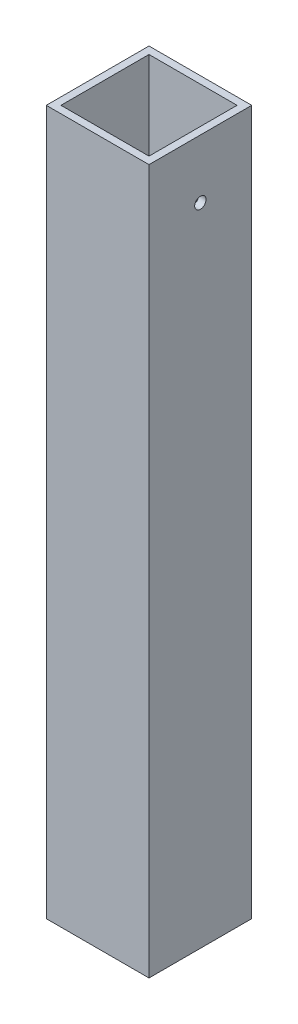
ISO-10303-21;
HEADER;
FILE_DESCRIPTION(('STEP AP214'),'2;1');
FILE_NAME('part.step','',(''),(''),'','','');
FILE_SCHEMA(('AUTOMOTIVE_DESIGN { 1 0 10303 214 1 1 1 1 }'));
ENDSEC;
DATA;
#1=APPLICATION_CONTEXT('core data for automotive mechanical design processes');
#2=APPLICATION_PROTOCOL_DEFINITION('international standard','automotive_design',2000,#1);
#3=PRODUCT_CONTEXT('',#1,'mechanical');
#4=PRODUCT('Part','Part','',(#3));
#5=PRODUCT_RELATED_PRODUCT_CATEGORY('part','',(#4));
#6=PRODUCT_DEFINITION_FORMATION('','',#4);
#7=PRODUCT_DEFINITION_CONTEXT('part definition',#1,'design');
#8=PRODUCT_DEFINITION('design','',#6,#7);
#9=PRODUCT_DEFINITION_SHAPE('','',#8);
#10=(LENGTH_UNIT() NAMED_UNIT(*) SI_UNIT(.MILLI.,.METRE.));
#11=(NAMED_UNIT(*) PLANE_ANGLE_UNIT() SI_UNIT($,.RADIAN.));
#12=(NAMED_UNIT(*) SI_UNIT($,.STERADIAN.) SOLID_ANGLE_UNIT());
#13=UNCERTAINTY_MEASURE_WITH_UNIT(LENGTH_MEASURE(1.E-05),#10,'distance_accuracy_value','');
#14=(GEOMETRIC_REPRESENTATION_CONTEXT(3) GLOBAL_UNCERTAINTY_ASSIGNED_CONTEXT((#13)) GLOBAL_UNIT_ASSIGNED_CONTEXT((#10,
#11,#12)) REPRESENTATION_CONTEXT('',''));
#15=CARTESIAN_POINT('',(0.,0.,0.));
#16=DIRECTION('',(0.,0.,1.));
#17=DIRECTION('',(1.,0.,0.));
#18=AXIS2_PLACEMENT_3D('',#15,#16,#17);
#19=CARTESIAN_POINT('',(746.266107909946,-485.775,1.37475685413339E-13));
#20=DIRECTION('',(1.,0.,0.));
#21=DIRECTION('',(0.,0.,-1.));
#22=AXIS2_PLACEMENT_3D('',#19,#20,#21);
#23=CYLINDRICAL_SURFACE('',#22,2.45745);
#24=CARTESIAN_POINT('',(22.2250000000001,-485.775,0.));
#25=DIRECTION('',(1.,0.,0.));
#26=DIRECTION('',(0.,0.,-1.));
#27=AXIS2_PLACEMENT_3D('',#24,#25,#26);
#28=CIRCLE('',#27,2.45745);
#29=CARTESIAN_POINT('',(22.2250000000001,-485.775,-2.45745));
#30=VERTEX_POINT('',#29);
#31=EDGE_CURVE('E111',#30,#30,#28,.T.);
#32=ORIENTED_EDGE('',*,*,#31,.T.);
#33=EDGE_LOOP('',(#32));
#34=FACE_BOUND('',#33,.T.);
#35=CARTESIAN_POINT('',(19.05,-485.775,0.));
#36=DIRECTION('',(1.,0.,0.));
#37=DIRECTION('',(0.,0.,-1.));
#38=AXIS2_PLACEMENT_3D('',#35,#36,#37);
#39=CIRCLE('',#38,2.45745);
#40=CARTESIAN_POINT('',(19.05,-485.775,-2.45745));
#41=VERTEX_POINT('',#40);
#42=EDGE_CURVE('E17',#41,#41,#39,.T.);
#43=ORIENTED_EDGE('',*,*,#42,.F.);
#44=EDGE_LOOP('',(#43));
#45=FACE_BOUND('',#44,.T.);
#46=ADVANCED_FACE('F14',(#34,#45),#23,.F.);
#47=CARTESIAN_POINT('',(746.266107909946,-485.775,1.37475685413339E-13));
#48=DIRECTION('',(1.,0.,0.));
#49=DIRECTION('',(0.,0.,-1.));
#50=AXIS2_PLACEMENT_3D('',#47,#48,#49);
#51=CYLINDRICAL_SURFACE('',#50,2.45745);
#52=CARTESIAN_POINT('',(-19.05,-485.775,0.));
#53=DIRECTION('',(1.,0.,0.));
#54=DIRECTION('',(0.,0.,-1.));
#55=AXIS2_PLACEMENT_3D('',#52,#53,#54);
#56=CIRCLE('',#55,2.45745);
#57=CARTESIAN_POINT('',(-19.05,-485.775,-2.45745));
#58=VERTEX_POINT('',#57);
#59=EDGE_CURVE('E115',#58,#58,#56,.T.);
#60=ORIENTED_EDGE('',*,*,#59,.T.);
#61=EDGE_LOOP('',(#60));
#62=FACE_BOUND('',#61,.T.);
#63=CARTESIAN_POINT('',(-22.2250000000001,-485.775,0.));
#64=DIRECTION('',(1.,0.,0.));
#65=DIRECTION('',(0.,0.,-1.));
#66=AXIS2_PLACEMENT_3D('',#63,#64,#65);
#67=CIRCLE('',#66,2.45745);
#68=CARTESIAN_POINT('',(-22.2250000000001,-485.775,-2.45745));
#69=VERTEX_POINT('',#68);
#70=EDGE_CURVE('E117',#69,#69,#67,.T.);
#71=ORIENTED_EDGE('',*,*,#70,.F.);
#72=EDGE_LOOP('',(#71));
#73=FACE_BOUND('',#72,.T.);
#74=ADVANCED_FACE('F126',(#62,#73),#51,.F.);
#75=CARTESIAN_POINT('',(19.05,-460.375,-3.75820513665676));
#76=DIRECTION('',(-1.,0.,0.));
#77=DIRECTION('',(0.,0.,1.));
#78=AXIS2_PLACEMENT_3D('',#75,#76,#77);
#79=PLANE('',#78);
#80=DIRECTION('',(0.,0.,1.));
#81=VECTOR('',#80,1.);
#82=CARTESIAN_POINT('',(19.05,-460.375,0.));
#83=LINE('',#82,#81);
#84=CARTESIAN_POINT('',(19.05,-460.375,-19.05));
#85=VERTEX_POINT('',#84);
#86=CARTESIAN_POINT('',(19.05,-460.375,19.05));
#87=VERTEX_POINT('',#86);
#88=EDGE_CURVE('E95',#85,#87,#83,.T.);
#89=ORIENTED_EDGE('',*,*,#88,.F.);
#90=DIRECTION('',(0.,1.,0.));
#91=VECTOR('',#90,1.);
#92=CARTESIAN_POINT('',(19.05,-460.375,-19.05));
#93=LINE('',#92,#91);
#94=CARTESIAN_POINT('',(19.05,-765.175,-19.05));
#95=VERTEX_POINT('',#94);
#96=EDGE_CURVE('E82',#95,#85,#93,.T.);
#97=ORIENTED_EDGE('',*,*,#96,.F.);
#98=DIRECTION('',(0.,0.,1.));
#99=VECTOR('',#98,1.);
#100=CARTESIAN_POINT('',(19.05,-765.175,0.));
#101=LINE('',#100,#99);
#102=CARTESIAN_POINT('',(19.05,-765.175,19.05));
#103=VERTEX_POINT('',#102);
#104=EDGE_CURVE('E180',#95,#103,#101,.T.);
#105=ORIENTED_EDGE('',*,*,#104,.T.);
#106=DIRECTION('',(0.,1.,0.));
#107=VECTOR('',#106,1.);
#108=CARTESIAN_POINT('',(19.05,-460.375,19.05));
#109=LINE('',#108,#107);
#110=EDGE_CURVE('E102',#103,#87,#109,.T.);
#111=ORIENTED_EDGE('',*,*,#110,.T.);
#112=EDGE_LOOP('',(#89,#97,#105,#111));
#113=FACE_BOUND('',#112,.T.);
#114=ORIENTED_EDGE('',*,*,#42,.T.);
#115=EDGE_LOOP('',(#114));
#116=FACE_BOUND('',#115,.T.);
#117=ADVANCED_FACE('F100',(#113,#116),#79,.T.);
#118=CARTESIAN_POINT('',(1.89634043574333,-460.375,19.05));
#119=DIRECTION('',(0.,0.,1.));
#120=DIRECTION('',(1.,0.,0.));
#121=AXIS2_PLACEMENT_3D('',#118,#119,#120);
#122=PLANE('',#121);
#123=DIRECTION('',(0.,1.,0.));
#124=VECTOR('',#123,1.);
#125=CARTESIAN_POINT('',(-19.05,-460.375,19.05));
#126=LINE('',#125,#124);
#127=CARTESIAN_POINT('',(-19.05,-765.175,19.05));
#128=VERTEX_POINT('',#127);
#129=CARTESIAN_POINT('',(-19.05,-460.375,19.05));
#130=VERTEX_POINT('',#129);
#131=EDGE_CURVE('E91',#128,#130,#126,.T.);
#132=ORIENTED_EDGE('',*,*,#131,.T.);
#133=DIRECTION('',(1.,0.,0.));
#134=VECTOR('',#133,1.);
#135=CARTESIAN_POINT('',(-192.0875,-460.375,19.05));
#136=LINE('',#135,#134);
#137=EDGE_CURVE('E104',#87,#130,#136,.F.);
#138=ORIENTED_EDGE('',*,*,#137,.F.);
#139=ORIENTED_EDGE('',*,*,#110,.F.);
#140=DIRECTION('',(1.,0.,0.));
#141=VECTOR('',#140,1.);
#142=CARTESIAN_POINT('',(-192.0875,-765.175,19.05));
#143=LINE('',#142,#141);
#144=EDGE_CURVE('E182',#103,#128,#143,.F.);
#145=ORIENTED_EDGE('',*,*,#144,.T.);
#146=EDGE_LOOP('',(#132,#138,#139,#145));
#147=FACE_BOUND('',#146,.T.);
#148=ADVANCED_FACE('F131',(#147),#122,.F.);
#149=CARTESIAN_POINT('',(-19.05,-460.375,-3.75820513665677));
#150=DIRECTION('',(-1.,0.,0.));
#151=DIRECTION('',(0.,0.,1.));
#152=AXIS2_PLACEMENT_3D('',#149,#150,#151);
#153=PLANE('',#152);
#154=DIRECTION('',(0.,1.,0.));
#155=VECTOR('',#154,1.);
#156=CARTESIAN_POINT('',(-19.05,-460.375,-19.05));
#157=LINE('',#156,#155);
#158=CARTESIAN_POINT('',(-19.05,-460.375,-19.05));
#159=VERTEX_POINT('',#158);
#160=CARTESIAN_POINT('',(-19.05,-765.175,-19.05));
#161=VERTEX_POINT('',#160);
#162=EDGE_CURVE('E75',#159,#161,#157,.F.);
#163=ORIENTED_EDGE('',*,*,#162,.F.);
#164=DIRECTION('',(0.,0.,1.));
#165=VECTOR('',#164,1.);
#166=CARTESIAN_POINT('',(-19.05,-460.375,0.));
#167=LINE('',#166,#165);
#168=EDGE_CURVE('E97',#130,#159,#167,.F.);
#169=ORIENTED_EDGE('',*,*,#168,.F.);
#170=ORIENTED_EDGE('',*,*,#131,.F.);
#171=DIRECTION('',(0.,0.,1.));
#172=VECTOR('',#171,1.);
#173=CARTESIAN_POINT('',(-19.05,-765.175,0.));
#174=LINE('',#173,#172);
#175=EDGE_CURVE('E202',#128,#161,#174,.F.);
#176=ORIENTED_EDGE('',*,*,#175,.T.);
#177=EDGE_LOOP('',(#163,#169,#170,#176));
#178=FACE_BOUND('',#177,.T.);
#179=ORIENTED_EDGE('',*,*,#59,.F.);
#180=EDGE_LOOP('',(#179));
#181=FACE_BOUND('',#180,.T.);
#182=ADVANCED_FACE('F129',(#178,#181),#153,.F.);
#183=CARTESIAN_POINT('',(0.,-460.375,-19.05));
#184=DIRECTION('',(0.,0.,1.));
#185=DIRECTION('',(1.,0.,0.));
#186=AXIS2_PLACEMENT_3D('',#183,#184,#185);
#187=PLANE('',#186);
#188=DIRECTION('',(1.,0.,0.));
#189=VECTOR('',#188,1.);
#190=CARTESIAN_POINT('',(-192.0875,-460.375,-19.05));
#191=LINE('',#190,#189);
#192=EDGE_CURVE('E85',#159,#85,#191,.T.);
#193=ORIENTED_EDGE('',*,*,#192,.F.);
#194=ORIENTED_EDGE('',*,*,#162,.T.);
#195=DIRECTION('',(1.,0.,0.));
#196=VECTOR('',#195,1.);
#197=CARTESIAN_POINT('',(-192.0875,-765.175,-19.05));
#198=LINE('',#197,#196);
#199=EDGE_CURVE('E87',#161,#95,#198,.T.);
#200=ORIENTED_EDGE('',*,*,#199,.T.);
#201=ORIENTED_EDGE('',*,*,#96,.T.);
#202=EDGE_LOOP('',(#193,#194,#200,#201));
#203=FACE_BOUND('',#202,.T.);
#204=ADVANCED_FACE('F84',(#203),#187,.T.);
#205=CARTESIAN_POINT('',(-192.0875,-460.375,22.225));
#206=DIRECTION('',(0.,0.,1.));
#207=DIRECTION('',(1.,0.,0.));
#208=AXIS2_PLACEMENT_3D('',#205,#206,#207);
#209=PLANE('',#208);
#210=DIRECTION('',(1.,0.,0.));
#211=VECTOR('',#210,1.);
#212=CARTESIAN_POINT('',(-192.0875,-460.375,22.225));
#213=LINE('',#212,#211);
#214=CARTESIAN_POINT('',(-22.225,-460.375,22.225));
#215=VERTEX_POINT('',#214);
#216=CARTESIAN_POINT('',(22.225,-460.375,22.225));
#217=VERTEX_POINT('',#216);
#218=EDGE_CURVE('E170',#215,#217,#213,.T.);
#219=ORIENTED_EDGE('',*,*,#218,.F.);
#220=DIRECTION('',(0.,1.,0.));
#221=VECTOR('',#220,1.);
#222=CARTESIAN_POINT('',(-22.225,-460.375,22.225));
#223=LINE('',#222,#221);
#224=CARTESIAN_POINT('',(-22.225,-765.175,22.225));
#225=VERTEX_POINT('',#224);
#226=EDGE_CURVE('E120',#225,#215,#223,.T.);
#227=ORIENTED_EDGE('',*,*,#226,.F.);
#228=DIRECTION('',(1.,0.,0.));
#229=VECTOR('',#228,1.);
#230=CARTESIAN_POINT('',(-192.0875,-765.175,22.225));
#231=LINE('',#230,#229);
#232=CARTESIAN_POINT('',(22.225,-765.175,22.225));
#233=VERTEX_POINT('',#232);
#234=EDGE_CURVE('E199',#225,#233,#231,.T.);
#235=ORIENTED_EDGE('',*,*,#234,.T.);
#236=DIRECTION('',(0.,1.,0.));
#237=VECTOR('',#236,1.);
#238=CARTESIAN_POINT('',(22.225,-460.375,22.225));
#239=LINE('',#238,#237);
#240=EDGE_CURVE('E98',#233,#217,#239,.T.);
#241=ORIENTED_EDGE('',*,*,#240,.T.);
#242=EDGE_LOOP('',(#219,#227,#235,#241));
#243=FACE_BOUND('',#242,.T.);
#244=ADVANCED_FACE('F138',(#243),#209,.T.);
#245=CARTESIAN_POINT('',(22.225,-460.375,-3.75820513665676));
#246=DIRECTION('',(-1.,0.,0.));
#247=DIRECTION('',(0.,0.,1.));
#248=AXIS2_PLACEMENT_3D('',#245,#246,#247);
#249=PLANE('',#248);
#250=DIRECTION('',(0.,1.,0.));
#251=VECTOR('',#250,1.);
#252=CARTESIAN_POINT('',(22.225,-460.375,-22.225));
#253=LINE('',#252,#251);
#254=CARTESIAN_POINT('',(22.225,-765.175,-22.225));
#255=VERTEX_POINT('',#254);
#256=CARTESIAN_POINT('',(22.225,-460.375,-22.225));
#257=VERTEX_POINT('',#256);
#258=EDGE_CURVE('E188',#255,#257,#253,.T.);
#259=ORIENTED_EDGE('',*,*,#258,.T.);
#260=DIRECTION('',(0.,0.,1.));
#261=VECTOR('',#260,1.);
#262=CARTESIAN_POINT('',(22.225,-460.375,0.));
#263=LINE('',#262,#261);
#264=EDGE_CURVE('E121',#217,#257,#263,.F.);
#265=ORIENTED_EDGE('',*,*,#264,.F.);
#266=ORIENTED_EDGE('',*,*,#240,.F.);
#267=DIRECTION('',(0.,0.,1.));
#268=VECTOR('',#267,1.);
#269=CARTESIAN_POINT('',(22.225,-765.175,0.));
#270=LINE('',#269,#268);
#271=EDGE_CURVE('E193',#233,#255,#270,.F.);
#272=ORIENTED_EDGE('',*,*,#271,.T.);
#273=EDGE_LOOP('',(#259,#265,#266,#272));
#274=FACE_BOUND('',#273,.T.);
#275=ORIENTED_EDGE('',*,*,#31,.F.);
#276=EDGE_LOOP('',(#275));
#277=FACE_BOUND('',#276,.T.);
#278=ADVANCED_FACE('F159',(#274,#277),#249,.F.);
#279=CARTESIAN_POINT('',(-192.0875,-460.375,0.));
#280=DIRECTION('',(0.,1.,0.));
#281=DIRECTION('',(0.,0.,1.));
#282=AXIS2_PLACEMENT_3D('',#279,#280,#281);
#283=PLANE('',#282);
#284=ORIENTED_EDGE('',*,*,#264,.T.);
#285=DIRECTION('',(1.,0.,0.));
#286=VECTOR('',#285,1.);
#287=CARTESIAN_POINT('',(-192.0875,-460.375,-22.225));
#288=LINE('',#287,#286);
#289=CARTESIAN_POINT('',(-22.225,-460.375,-22.225));
#290=VERTEX_POINT('',#289);
#291=EDGE_CURVE('E178',#257,#290,#288,.F.);
#292=ORIENTED_EDGE('',*,*,#291,.T.);
#293=DIRECTION('',(0.,0.,1.));
#294=VECTOR('',#293,1.);
#295=CARTESIAN_POINT('',(-22.225,-460.375,-3.75820513665677));
#296=LINE('',#295,#294);
#297=EDGE_CURVE('E176',#215,#290,#296,.F.);
#298=ORIENTED_EDGE('',*,*,#297,.F.);
#299=ORIENTED_EDGE('',*,*,#218,.T.);
#300=EDGE_LOOP('',(#284,#292,#298,#299));
#301=FACE_BOUND('',#300,.T.);
#302=ORIENTED_EDGE('',*,*,#137,.T.);
#303=ORIENTED_EDGE('',*,*,#168,.T.);
#304=ORIENTED_EDGE('',*,*,#192,.T.);
#305=ORIENTED_EDGE('',*,*,#88,.T.);
#306=EDGE_LOOP('',(#302,#303,#304,#305));
#307=FACE_BOUND('',#306,.T.);
#308=ADVANCED_FACE('F94',(#301,#307),#283,.T.);
#309=CARTESIAN_POINT('',(-22.225,-460.375,-3.75820513665677));
#310=DIRECTION('',(-1.,0.,0.));
#311=DIRECTION('',(0.,0.,1.));
#312=AXIS2_PLACEMENT_3D('',#309,#310,#311);
#313=PLANE('',#312);
#314=ORIENTED_EDGE('',*,*,#297,.T.);
#315=DIRECTION('',(0.,1.,0.));
#316=VECTOR('',#315,1.);
#317=CARTESIAN_POINT('',(-22.225,-460.375,-22.225));
#318=LINE('',#317,#316);
#319=CARTESIAN_POINT('',(-22.225,-765.175,-22.225));
#320=VERTEX_POINT('',#319);
#321=EDGE_CURVE('E23',#290,#320,#318,.F.);
#322=ORIENTED_EDGE('',*,*,#321,.T.);
#323=DIRECTION('',(0.,0.,1.));
#324=VECTOR('',#323,1.);
#325=CARTESIAN_POINT('',(-22.225,-765.175,0.));
#326=LINE('',#325,#324);
#327=EDGE_CURVE('E31',#320,#225,#326,.T.);
#328=ORIENTED_EDGE('',*,*,#327,.T.);
#329=ORIENTED_EDGE('',*,*,#226,.T.);
#330=EDGE_LOOP('',(#314,#322,#328,#329));
#331=FACE_BOUND('',#330,.T.);
#332=ORIENTED_EDGE('',*,*,#70,.T.);
#333=EDGE_LOOP('',(#332));
#334=FACE_BOUND('',#333,.T.);
#335=ADVANCED_FACE('F150',(#331,#334),#313,.T.);
#336=CARTESIAN_POINT('',(-192.0875,-765.175,0.));
#337=DIRECTION('',(0.,1.,0.));
#338=DIRECTION('',(0.,0.,1.));
#339=AXIS2_PLACEMENT_3D('',#336,#337,#338);
#340=PLANE('',#339);
#341=DIRECTION('',(1.,0.,0.));
#342=VECTOR('',#341,1.);
#343=CARTESIAN_POINT('',(-192.0875,-765.175,-22.225));
#344=LINE('',#343,#342);
#345=EDGE_CURVE('E9',#320,#255,#344,.T.);
#346=ORIENTED_EDGE('',*,*,#345,.T.);
#347=ORIENTED_EDGE('',*,*,#271,.F.);
#348=ORIENTED_EDGE('',*,*,#234,.F.);
#349=ORIENTED_EDGE('',*,*,#327,.F.);
#350=EDGE_LOOP('',(#346,#347,#348,#349));
#351=FACE_BOUND('',#350,.T.);
#352=ORIENTED_EDGE('',*,*,#175,.F.);
#353=ORIENTED_EDGE('',*,*,#144,.F.);
#354=ORIENTED_EDGE('',*,*,#104,.F.);
#355=ORIENTED_EDGE('',*,*,#199,.F.);
#356=EDGE_LOOP('',(#352,#353,#354,#355));
#357=FACE_BOUND('',#356,.T.);
#358=ADVANCED_FACE('F144',(#351,#357),#340,.F.);
#359=CARTESIAN_POINT('',(-192.0875,-460.375,-22.225));
#360=DIRECTION('',(0.,0.,1.));
#361=DIRECTION('',(1.,0.,0.));
#362=AXIS2_PLACEMENT_3D('',#359,#360,#361);
#363=PLANE('',#362);
#364=ORIENTED_EDGE('',*,*,#321,.F.);
#365=ORIENTED_EDGE('',*,*,#291,.F.);
#366=ORIENTED_EDGE('',*,*,#258,.F.);
#367=ORIENTED_EDGE('',*,*,#345,.F.);
#368=EDGE_LOOP('',(#364,#365,#366,#367));
#369=FACE_BOUND('',#368,.T.);
#370=ADVANCED_FACE('F142',(#369),#363,.F.);
#371=CLOSED_SHELL('',(#46,#74,#117,#148,#182,#204,#244,#278,#308,#335,#358,#370));
#372=MANIFOLD_SOLID_BREP('B1',#371);
#373=ADVANCED_BREP_SHAPE_REPRESENTATION('',(#18,#372),#14);
#374=SHAPE_DEFINITION_REPRESENTATION(#9,#373);
ENDSEC;
END-ISO-10303-21;
